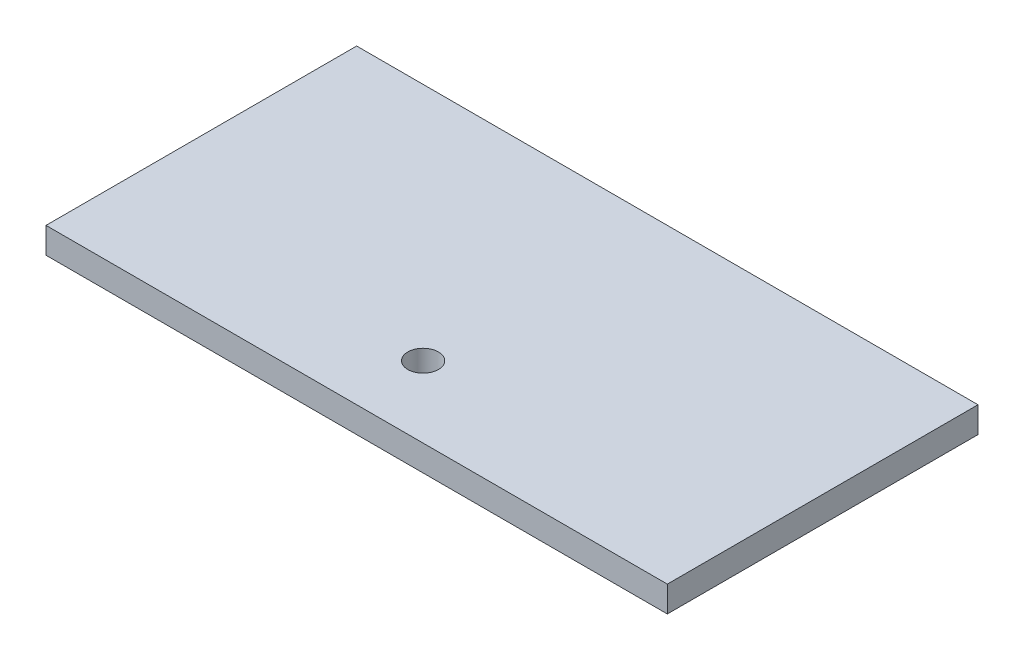
ISO-10303-21;
HEADER;
FILE_DESCRIPTION(('STEP AP214'),'2;1');
FILE_NAME('part.step','',(''),(''),'','','');
FILE_SCHEMA(('AUTOMOTIVE_DESIGN { 1 0 10303 214 1 1 1 1 }'));
ENDSEC;
DATA;
#1=APPLICATION_CONTEXT('core data for automotive mechanical design processes');
#2=APPLICATION_PROTOCOL_DEFINITION('international standard','automotive_design',2000,#1);
#3=PRODUCT_CONTEXT('',#1,'mechanical');
#4=PRODUCT('Part','Part','',(#3));
#5=PRODUCT_RELATED_PRODUCT_CATEGORY('part','',(#4));
#6=PRODUCT_DEFINITION_FORMATION('','',#4);
#7=PRODUCT_DEFINITION_CONTEXT('part definition',#1,'design');
#8=PRODUCT_DEFINITION('design','',#6,#7);
#9=PRODUCT_DEFINITION_SHAPE('','',#8);
#10=(LENGTH_UNIT() NAMED_UNIT(*) SI_UNIT(.MILLI.,.METRE.));
#11=(NAMED_UNIT(*) PLANE_ANGLE_UNIT() SI_UNIT($,.RADIAN.));
#12=(NAMED_UNIT(*) SI_UNIT($,.STERADIAN.) SOLID_ANGLE_UNIT());
#13=UNCERTAINTY_MEASURE_WITH_UNIT(LENGTH_MEASURE(1.E-05),#10,'distance_accuracy_value','');
#14=(GEOMETRIC_REPRESENTATION_CONTEXT(3) GLOBAL_UNCERTAINTY_ASSIGNED_CONTEXT((#13)) GLOBAL_UNIT_ASSIGNED_CONTEXT((#10,
#11,#12)) REPRESENTATION_CONTEXT('',''));
#15=CARTESIAN_POINT('',(0.,0.,0.));
#16=DIRECTION('',(0.,0.,1.));
#17=DIRECTION('',(1.,0.,0.));
#18=AXIS2_PLACEMENT_3D('',#15,#16,#17);
#19=CARTESIAN_POINT('',(0.,25.4,0.));
#20=DIRECTION('',(1.,0.,0.));
#21=DIRECTION('',(0.,0.,-1.));
#22=AXIS2_PLACEMENT_3D('',#19,#20,#21);
#23=PLANE('',#22);
#24=DIRECTION('',(0.,0.,1.));
#25=VECTOR('',#24,1.);
#26=CARTESIAN_POINT('',(0.,0.,0.));
#27=LINE('',#26,#25);
#28=CARTESIAN_POINT('',(0.,0.,-304.8));
#29=VERTEX_POINT('',#28);
#30=CARTESIAN_POINT('',(0.,0.,0.));
#31=VERTEX_POINT('',#30);
#32=EDGE_CURVE('E93',#29,#31,#27,.T.);
#33=ORIENTED_EDGE('',*,*,#32,.T.);
#34=DIRECTION('',(0.,-1.,0.));
#35=VECTOR('',#34,1.);
#36=CARTESIAN_POINT('',(0.,25.4,0.));
#37=LINE('',#36,#35);
#38=CARTESIAN_POINT('',(0.,25.4,0.));
#39=VERTEX_POINT('',#38);
#40=EDGE_CURVE('E11',#39,#31,#37,.T.);
#41=ORIENTED_EDGE('',*,*,#40,.F.);
#42=DIRECTION('',(0.,0.,1.));
#43=VECTOR('',#42,1.);
#44=CARTESIAN_POINT('',(0.,25.4,0.));
#45=LINE('',#44,#43);
#46=CARTESIAN_POINT('',(0.,25.4,-304.8));
#47=VERTEX_POINT('',#46);
#48=EDGE_CURVE('E81',#47,#39,#45,.T.);
#49=ORIENTED_EDGE('',*,*,#48,.F.);
#50=DIRECTION('',(0.,-1.,0.));
#51=VECTOR('',#50,1.);
#52=CARTESIAN_POINT('',(0.,25.4,-304.8));
#53=LINE('',#52,#51);
#54=EDGE_CURVE('E89',#47,#29,#53,.T.);
#55=ORIENTED_EDGE('',*,*,#54,.T.);
#56=EDGE_LOOP('',(#33,#41,#49,#55));
#57=FACE_BOUND('',#56,.T.);
#58=ADVANCED_FACE('F30',(#57),#23,.F.);
#59=CARTESIAN_POINT('',(0.,25.4,0.));
#60=DIRECTION('',(0.,0.,-1.));
#61=DIRECTION('',(-1.,0.,0.));
#62=AXIS2_PLACEMENT_3D('',#59,#60,#61);
#63=PLANE('',#62);
#64=DIRECTION('',(1.,0.,0.));
#65=VECTOR('',#64,1.);
#66=CARTESIAN_POINT('',(0.,0.,0.));
#67=LINE('',#66,#65);
#68=CARTESIAN_POINT('',(609.6,0.,0.));
#69=VERTEX_POINT('',#68);
#70=EDGE_CURVE('E85',#31,#69,#67,.T.);
#71=ORIENTED_EDGE('',*,*,#70,.T.);
#72=DIRECTION('',(0.,-1.,0.));
#73=VECTOR('',#72,1.);
#74=CARTESIAN_POINT('',(609.6,25.4,0.));
#75=LINE('',#74,#73);
#76=CARTESIAN_POINT('',(609.6,25.4,0.));
#77=VERTEX_POINT('',#76);
#78=EDGE_CURVE('E38',#77,#69,#75,.T.);
#79=ORIENTED_EDGE('',*,*,#78,.F.);
#80=DIRECTION('',(1.,0.,0.));
#81=VECTOR('',#80,1.);
#82=CARTESIAN_POINT('',(0.,25.4,0.));
#83=LINE('',#82,#81);
#84=EDGE_CURVE('E76',#39,#77,#83,.T.);
#85=ORIENTED_EDGE('',*,*,#84,.F.);
#86=ORIENTED_EDGE('',*,*,#40,.T.);
#87=EDGE_LOOP('',(#71,#79,#85,#86));
#88=FACE_BOUND('',#87,.T.);
#89=ADVANCED_FACE('F84',(#88),#63,.F.);
#90=CARTESIAN_POINT('',(609.6,25.4,0.));
#91=DIRECTION('',(-1.,0.,0.));
#92=DIRECTION('',(0.,0.,1.));
#93=AXIS2_PLACEMENT_3D('',#90,#91,#92);
#94=PLANE('',#93);
#95=DIRECTION('',(0.,0.,-1.));
#96=VECTOR('',#95,1.);
#97=CARTESIAN_POINT('',(609.6,0.,0.));
#98=LINE('',#97,#96);
#99=CARTESIAN_POINT('',(609.6,0.,-304.8));
#100=VERTEX_POINT('',#99);
#101=EDGE_CURVE('E63',#69,#100,#98,.T.);
#102=ORIENTED_EDGE('',*,*,#101,.T.);
#103=DIRECTION('',(0.,-1.,0.));
#104=VECTOR('',#103,1.);
#105=CARTESIAN_POINT('',(609.6,25.4,-304.8));
#106=LINE('',#105,#104);
#107=CARTESIAN_POINT('',(609.6,25.4,-304.8));
#108=VERTEX_POINT('',#107);
#109=EDGE_CURVE('E86',#108,#100,#106,.T.);
#110=ORIENTED_EDGE('',*,*,#109,.F.);
#111=DIRECTION('',(0.,0.,-1.));
#112=VECTOR('',#111,1.);
#113=CARTESIAN_POINT('',(609.6,25.4,0.));
#114=LINE('',#113,#112);
#115=EDGE_CURVE('E79',#77,#108,#114,.T.);
#116=ORIENTED_EDGE('',*,*,#115,.F.);
#117=ORIENTED_EDGE('',*,*,#78,.T.);
#118=EDGE_LOOP('',(#102,#110,#116,#117));
#119=FACE_BOUND('',#118,.T.);
#120=ADVANCED_FACE('F87',(#119),#94,.F.);
#121=CARTESIAN_POINT('',(0.,25.4,-304.8));
#122=DIRECTION('',(0.,0.,1.));
#123=DIRECTION('',(1.,0.,0.));
#124=AXIS2_PLACEMENT_3D('',#121,#122,#123);
#125=PLANE('',#124);
#126=DIRECTION('',(-1.,0.,0.));
#127=VECTOR('',#126,1.);
#128=CARTESIAN_POINT('',(0.,0.,-304.8));
#129=LINE('',#128,#127);
#130=EDGE_CURVE('E69',#100,#29,#129,.T.);
#131=ORIENTED_EDGE('',*,*,#130,.T.);
#132=ORIENTED_EDGE('',*,*,#54,.F.);
#133=DIRECTION('',(-1.,0.,0.));
#134=VECTOR('',#133,1.);
#135=CARTESIAN_POINT('',(0.,25.4,-304.8));
#136=LINE('',#135,#134);
#137=EDGE_CURVE('E46',#108,#47,#136,.T.);
#138=ORIENTED_EDGE('',*,*,#137,.F.);
#139=ORIENTED_EDGE('',*,*,#109,.T.);
#140=EDGE_LOOP('',(#131,#132,#138,#139));
#141=FACE_BOUND('',#140,.T.);
#142=ADVANCED_FACE('F101',(#141),#125,.F.);
#143=CARTESIAN_POINT('',(0.,25.4,-304.8));
#144=DIRECTION('',(0.,-1.,0.));
#145=DIRECTION('',(0.,0.,-1.));
#146=AXIS2_PLACEMENT_3D('',#143,#144,#145);
#147=PLANE('',#146);
#148=CARTESIAN_POINT('',(300.,25.4,-70.));
#149=DIRECTION('',(0.,1.,0.));
#150=DIRECTION('',(0.,0.,1.));
#151=AXIS2_PLACEMENT_3D('',#148,#149,#150);
#152=CIRCLE('',#151,15.);
#153=CARTESIAN_POINT('',(300.,25.4,-55.));
#154=VERTEX_POINT('',#153);
#155=EDGE_CURVE('E107',#154,#154,#152,.T.);
#156=ORIENTED_EDGE('',*,*,#155,.F.);
#157=EDGE_LOOP('',(#156));
#158=FACE_BOUND('',#157,.T.);
#159=ORIENTED_EDGE('',*,*,#48,.T.);
#160=ORIENTED_EDGE('',*,*,#84,.T.);
#161=ORIENTED_EDGE('',*,*,#115,.T.);
#162=ORIENTED_EDGE('',*,*,#137,.T.);
#163=EDGE_LOOP('',(#159,#160,#161,#162));
#164=FACE_BOUND('',#163,.T.);
#165=ADVANCED_FACE('F77',(#158,#164),#147,.F.);
#166=CARTESIAN_POINT('',(0.,0.,-304.8));
#167=DIRECTION('',(0.,-1.,0.));
#168=DIRECTION('',(0.,0.,-1.));
#169=AXIS2_PLACEMENT_3D('',#166,#167,#168);
#170=PLANE('',#169);
#171=CARTESIAN_POINT('',(300.,0.,-70.));
#172=DIRECTION('',(0.,1.,0.));
#173=DIRECTION('',(0.,0.,1.));
#174=AXIS2_PLACEMENT_3D('',#171,#172,#173);
#175=CIRCLE('',#174,15.);
#176=CARTESIAN_POINT('',(300.,0.,-55.));
#177=VERTEX_POINT('',#176);
#178=EDGE_CURVE('E96',#177,#177,#175,.T.);
#179=ORIENTED_EDGE('',*,*,#178,.T.);
#180=EDGE_LOOP('',(#179));
#181=FACE_BOUND('',#180,.T.);
#182=ORIENTED_EDGE('',*,*,#32,.F.);
#183=ORIENTED_EDGE('',*,*,#130,.F.);
#184=ORIENTED_EDGE('',*,*,#101,.F.);
#185=ORIENTED_EDGE('',*,*,#70,.F.);
#186=EDGE_LOOP('',(#182,#183,#184,#185));
#187=FACE_BOUND('',#186,.T.);
#188=ADVANCED_FACE('F104',(#181,#187),#170,.T.);
#189=CARTESIAN_POINT('',(300.,0.,-70.));
#190=DIRECTION('',(0.,1.,0.));
#191=DIRECTION('',(0.,0.,1.));
#192=AXIS2_PLACEMENT_3D('',#189,#190,#191);
#193=CYLINDRICAL_SURFACE('',#192,15.);
#194=ORIENTED_EDGE('',*,*,#178,.F.);
#195=EDGE_LOOP('',(#194));
#196=FACE_BOUND('',#195,.T.);
#197=ORIENTED_EDGE('',*,*,#155,.T.);
#198=EDGE_LOOP('',(#197));
#199=FACE_BOUND('',#198,.T.);
#200=ADVANCED_FACE('F114',(#196,#199),#193,.F.);
#201=CLOSED_SHELL('',(#58,#89,#120,#142,#165,#188,#200));
#202=MANIFOLD_SOLID_BREP('B2',#201);
#203=ADVANCED_BREP_SHAPE_REPRESENTATION('',(#18,#202),#14);
#204=SHAPE_DEFINITION_REPRESENTATION(#9,#203);
ENDSEC;
END-ISO-10303-21;
